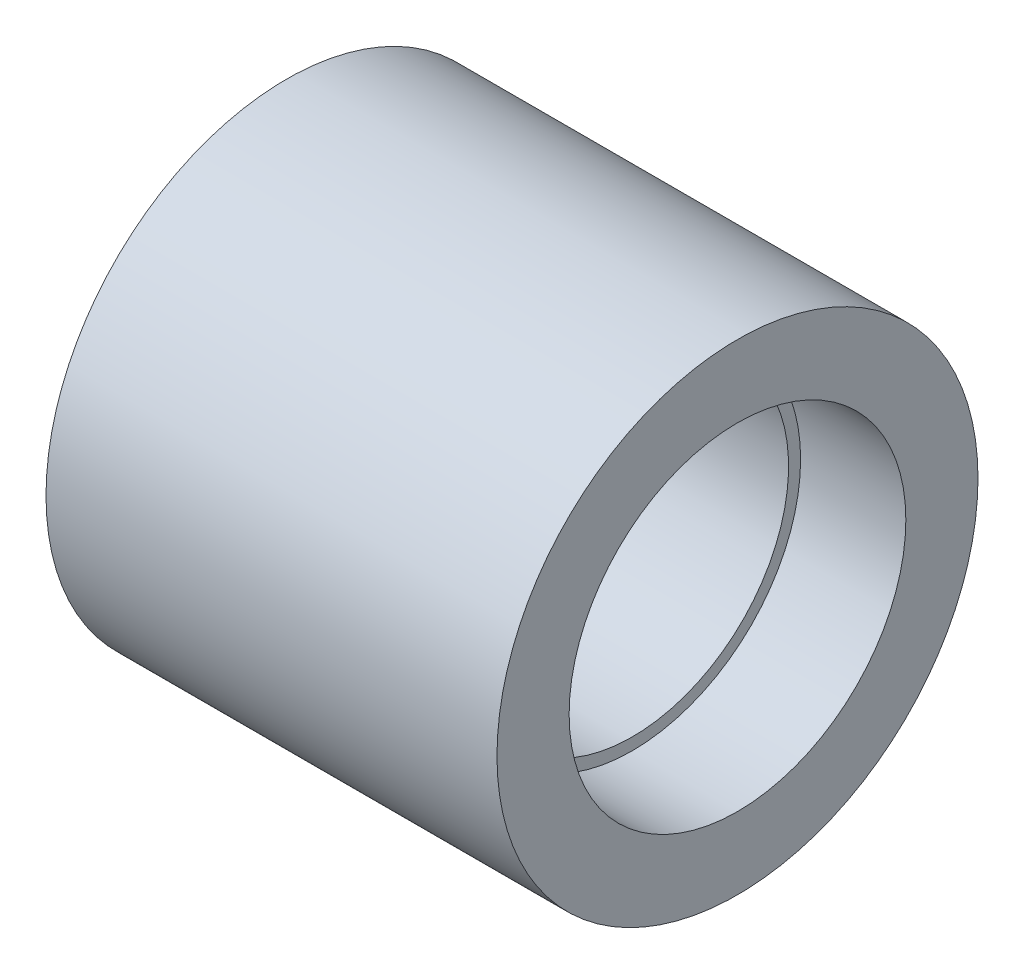
ISO-10303-21;
HEADER;
FILE_DESCRIPTION(('STEP AP214'),'2;1');
FILE_NAME('part.step','',(''),(''),'','','');
FILE_SCHEMA(('AUTOMOTIVE_DESIGN { 1 0 10303 214 1 1 1 1 }'));
ENDSEC;
DATA;
#1=APPLICATION_CONTEXT('core data for automotive mechanical design processes');
#2=APPLICATION_PROTOCOL_DEFINITION('international standard','automotive_design',2000,#1);
#3=PRODUCT_CONTEXT('',#1,'mechanical');
#4=PRODUCT('Part','Part','',(#3));
#5=PRODUCT_RELATED_PRODUCT_CATEGORY('part','',(#4));
#6=PRODUCT_DEFINITION_FORMATION('','',#4);
#7=PRODUCT_DEFINITION_CONTEXT('part definition',#1,'design');
#8=PRODUCT_DEFINITION('design','',#6,#7);
#9=PRODUCT_DEFINITION_SHAPE('','',#8);
#10=(LENGTH_UNIT() NAMED_UNIT(*) SI_UNIT(.MILLI.,.METRE.));
#11=(NAMED_UNIT(*) PLANE_ANGLE_UNIT() SI_UNIT($,.RADIAN.));
#12=(NAMED_UNIT(*) SI_UNIT($,.STERADIAN.) SOLID_ANGLE_UNIT());
#13=UNCERTAINTY_MEASURE_WITH_UNIT(LENGTH_MEASURE(1.E-05),#10,'distance_accuracy_value','');
#14=(GEOMETRIC_REPRESENTATION_CONTEXT(3) GLOBAL_UNCERTAINTY_ASSIGNED_CONTEXT((#13)) GLOBAL_UNIT_ASSIGNED_CONTEXT((#10,
#11,#12)) REPRESENTATION_CONTEXT('',''));
#15=CARTESIAN_POINT('',(0.,0.,0.));
#16=DIRECTION('',(0.,0.,1.));
#17=DIRECTION('',(1.,0.,0.));
#18=AXIS2_PLACEMENT_3D('',#15,#16,#17);
#19=CARTESIAN_POINT('',(37.5,0.,0.));
#20=DIRECTION('',(1.,0.,0.));
#21=DIRECTION('',(0.,0.,-1.));
#22=AXIS2_PLACEMENT_3D('',#19,#20,#21);
#23=PLANE('',#22);
#24=CARTESIAN_POINT('',(37.5000000000001,30.,0.));
#25=DIRECTION('',(-1.,0.,0.));
#26=DIRECTION('',(0.,0.,1.));
#27=AXIS2_PLACEMENT_3D('',#24,#25,#26);
#28=CIRCLE('',#27,28.);
#29=CARTESIAN_POINT('',(37.5000000000001,30.,28.));
#30=VERTEX_POINT('',#29);
#31=EDGE_CURVE('E74',#30,#30,#28,.T.);
#32=ORIENTED_EDGE('',*,*,#31,.T.);
#33=EDGE_LOOP('',(#32));
#34=FACE_BOUND('',#33,.T.);
#35=CARTESIAN_POINT('',(37.5000000000001,30.,0.));
#36=DIRECTION('',(-1.,0.,0.));
#37=DIRECTION('',(0.,0.,1.));
#38=AXIS2_PLACEMENT_3D('',#35,#36,#37);
#39=CIRCLE('',#38,40.);
#40=CARTESIAN_POINT('',(37.5000000000001,30.,40.));
#41=VERTEX_POINT('',#40);
#42=EDGE_CURVE('E10',#41,#41,#39,.T.);
#43=ORIENTED_EDGE('',*,*,#42,.F.);
#44=EDGE_LOOP('',(#43));
#45=FACE_BOUND('',#44,.T.);
#46=ADVANCED_FACE('F39',(#34,#45),#23,.T.);
#47=CARTESIAN_POINT('',(-1000.,30.,0.));
#48=DIRECTION('',(-1.,0.,0.));
#49=DIRECTION('',(0.,0.,1.));
#50=AXIS2_PLACEMENT_3D('',#47,#48,#49);
#51=CYLINDRICAL_SURFACE('',#50,40.);
#52=ORIENTED_EDGE('',*,*,#42,.T.);
#53=EDGE_LOOP('',(#52));
#54=FACE_BOUND('',#53,.T.);
#55=CARTESIAN_POINT('',(-37.5,30.,0.));
#56=DIRECTION('',(-1.,0.,0.));
#57=DIRECTION('',(0.,0.,1.));
#58=AXIS2_PLACEMENT_3D('',#55,#56,#57);
#59=CIRCLE('',#58,40.);
#60=CARTESIAN_POINT('',(-37.5,30.,40.));
#61=VERTEX_POINT('',#60);
#62=EDGE_CURVE('E46',#61,#61,#59,.T.);
#63=ORIENTED_EDGE('',*,*,#62,.F.);
#64=EDGE_LOOP('',(#63));
#65=FACE_BOUND('',#64,.T.);
#66=ADVANCED_FACE('F100',(#54,#65),#51,.T.);
#67=CARTESIAN_POINT('',(-37.5,0.,0.));
#68=DIRECTION('',(1.,0.,0.));
#69=DIRECTION('',(0.,0.,-1.));
#70=AXIS2_PLACEMENT_3D('',#67,#68,#69);
#71=PLANE('',#70);
#72=CARTESIAN_POINT('',(-37.5,30.,0.));
#73=DIRECTION('',(-1.,0.,0.));
#74=DIRECTION('',(0.,0.,1.));
#75=AXIS2_PLACEMENT_3D('',#72,#73,#74);
#76=CIRCLE('',#75,28.);
#77=CARTESIAN_POINT('',(-37.5,30.,28.));
#78=VERTEX_POINT('',#77);
#79=EDGE_CURVE('E51',#78,#78,#76,.T.);
#80=ORIENTED_EDGE('',*,*,#79,.F.);
#81=EDGE_LOOP('',(#80));
#82=FACE_BOUND('',#81,.T.);
#83=ORIENTED_EDGE('',*,*,#62,.T.);
#84=EDGE_LOOP('',(#83));
#85=FACE_BOUND('',#84,.T.);
#86=ADVANCED_FACE('F104',(#82,#85),#71,.F.);
#87=CARTESIAN_POINT('',(-1000.,30.,0.));
#88=DIRECTION('',(-1.,0.,0.));
#89=DIRECTION('',(0.,0.,1.));
#90=AXIS2_PLACEMENT_3D('',#87,#88,#89);
#91=CYLINDRICAL_SURFACE('',#90,28.);
#92=CARTESIAN_POINT('',(-20.,30.,0.));
#93=DIRECTION('',(-1.,0.,0.));
#94=DIRECTION('',(0.,0.,1.));
#95=AXIS2_PLACEMENT_3D('',#92,#93,#94);
#96=CIRCLE('',#95,28.);
#97=CARTESIAN_POINT('',(-20.,30.,28.));
#98=VERTEX_POINT('',#97);
#99=EDGE_CURVE('E56',#98,#98,#96,.T.);
#100=ORIENTED_EDGE('',*,*,#99,.F.);
#101=EDGE_LOOP('',(#100));
#102=FACE_BOUND('',#101,.T.);
#103=ORIENTED_EDGE('',*,*,#79,.T.);
#104=EDGE_LOOP('',(#103));
#105=FACE_BOUND('',#104,.T.);
#106=ADVANCED_FACE('F86',(#102,#105),#91,.F.);
#107=CARTESIAN_POINT('',(-20.,0.,0.));
#108=DIRECTION('',(1.,0.,0.));
#109=DIRECTION('',(0.,0.,-1.));
#110=AXIS2_PLACEMENT_3D('',#107,#108,#109);
#111=PLANE('',#110);
#112=CARTESIAN_POINT('',(-20.,30.,0.));
#113=DIRECTION('',(-1.,0.,0.));
#114=DIRECTION('',(0.,0.,1.));
#115=AXIS2_PLACEMENT_3D('',#112,#113,#114);
#116=CIRCLE('',#115,26.);
#117=CARTESIAN_POINT('',(-20.,30.,26.));
#118=VERTEX_POINT('',#117);
#119=EDGE_CURVE('E62',#118,#118,#116,.T.);
#120=ORIENTED_EDGE('',*,*,#119,.F.);
#121=EDGE_LOOP('',(#120));
#122=FACE_BOUND('',#121,.T.);
#123=ORIENTED_EDGE('',*,*,#99,.T.);
#124=EDGE_LOOP('',(#123));
#125=FACE_BOUND('',#124,.T.);
#126=ADVANCED_FACE('F96',(#122,#125),#111,.F.);
#127=CARTESIAN_POINT('',(-1000.,30.,0.));
#128=DIRECTION('',(-1.,0.,0.));
#129=DIRECTION('',(0.,0.,1.));
#130=AXIS2_PLACEMENT_3D('',#127,#128,#129);
#131=CYLINDRICAL_SURFACE('',#130,26.);
#132=CARTESIAN_POINT('',(20.,30.,0.));
#133=DIRECTION('',(-1.,0.,0.));
#134=DIRECTION('',(0.,0.,1.));
#135=AXIS2_PLACEMENT_3D('',#132,#133,#134);
#136=CIRCLE('',#135,26.);
#137=CARTESIAN_POINT('',(20.,30.,26.));
#138=VERTEX_POINT('',#137);
#139=EDGE_CURVE('E66',#138,#138,#136,.T.);
#140=ORIENTED_EDGE('',*,*,#139,.F.);
#141=EDGE_LOOP('',(#140));
#142=FACE_BOUND('',#141,.T.);
#143=ORIENTED_EDGE('',*,*,#119,.T.);
#144=EDGE_LOOP('',(#143));
#145=FACE_BOUND('',#144,.T.);
#146=ADVANCED_FACE('F90',(#142,#145),#131,.F.);
#147=CARTESIAN_POINT('',(20.,0.,0.));
#148=DIRECTION('',(1.,0.,0.));
#149=DIRECTION('',(0.,0.,-1.));
#150=AXIS2_PLACEMENT_3D('',#147,#148,#149);
#151=PLANE('',#150);
#152=ORIENTED_EDGE('',*,*,#139,.T.);
#153=EDGE_LOOP('',(#152));
#154=FACE_BOUND('',#153,.T.);
#155=CARTESIAN_POINT('',(20.,30.,0.));
#156=DIRECTION('',(-1.,0.,0.));
#157=DIRECTION('',(0.,0.,1.));
#158=AXIS2_PLACEMENT_3D('',#155,#156,#157);
#159=CIRCLE('',#158,28.);
#160=CARTESIAN_POINT('',(20.,30.,28.));
#161=VERTEX_POINT('',#160);
#162=EDGE_CURVE('E70',#161,#161,#159,.T.);
#163=ORIENTED_EDGE('',*,*,#162,.F.);
#164=EDGE_LOOP('',(#163));
#165=FACE_BOUND('',#164,.T.);
#166=ADVANCED_FACE('F84',(#154,#165),#151,.T.);
#167=ORIENTED_EDGE('',*,*,#31,.F.);
#168=EDGE_LOOP('',(#167));
#169=FACE_BOUND('',#168,.T.);
#170=ORIENTED_EDGE('',*,*,#162,.T.);
#171=EDGE_LOOP('',(#170));
#172=FACE_BOUND('',#171,.T.);
#173=ADVANCED_FACE('F81',(#169,#172),#91,.F.);
#174=CLOSED_SHELL('',(#46,#66,#86,#106,#126,#146,#166,#173));
#175=MANIFOLD_SOLID_BREP('B2',#174);
#176=ADVANCED_BREP_SHAPE_REPRESENTATION('',(#18,#175),#14);
#177=SHAPE_DEFINITION_REPRESENTATION(#9,#176);
ENDSEC;
END-ISO-10303-21;
